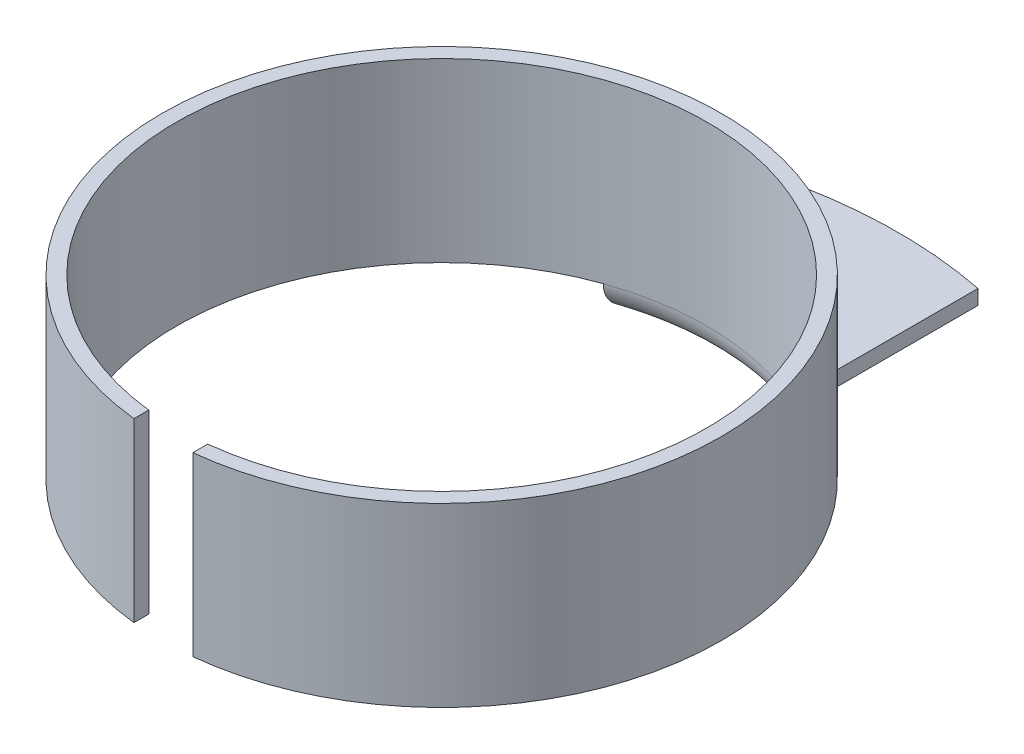
ISO-10303-21;
HEADER;
FILE_DESCRIPTION(('STEP AP214'),'2;1');
FILE_NAME('part.step','',(''),(''),'','','');
FILE_SCHEMA(('AUTOMOTIVE_DESIGN { 1 0 10303 214 1 1 1 1 }'));
ENDSEC;
DATA;
#1=APPLICATION_CONTEXT('core data for automotive mechanical design processes');
#2=APPLICATION_PROTOCOL_DEFINITION('international standard','automotive_design',2000,#1);
#3=PRODUCT_CONTEXT('',#1,'mechanical');
#4=PRODUCT('Part','Part','',(#3));
#5=PRODUCT_RELATED_PRODUCT_CATEGORY('part','',(#4));
#6=PRODUCT_DEFINITION_FORMATION('','',#4);
#7=PRODUCT_DEFINITION_CONTEXT('part definition',#1,'design');
#8=PRODUCT_DEFINITION('design','',#6,#7);
#9=PRODUCT_DEFINITION_SHAPE('','',#8);
#10=(LENGTH_UNIT() NAMED_UNIT(*) SI_UNIT(.MILLI.,.METRE.));
#11=(NAMED_UNIT(*) PLANE_ANGLE_UNIT() SI_UNIT($,.RADIAN.));
#12=(NAMED_UNIT(*) SI_UNIT($,.STERADIAN.) SOLID_ANGLE_UNIT());
#13=UNCERTAINTY_MEASURE_WITH_UNIT(LENGTH_MEASURE(1.E-05),#10,'distance_accuracy_value','');
#14=(GEOMETRIC_REPRESENTATION_CONTEXT(3) GLOBAL_UNCERTAINTY_ASSIGNED_CONTEXT((#13)) GLOBAL_UNIT_ASSIGNED_CONTEXT((#10,
#11,#12)) REPRESENTATION_CONTEXT('',''));
#15=CARTESIAN_POINT('',(0.,0.,0.));
#16=DIRECTION('',(0.,0.,1.));
#17=DIRECTION('',(1.,0.,0.));
#18=AXIS2_PLACEMENT_3D('',#15,#16,#17);
#19=CARTESIAN_POINT('',(0.,0.,0.));
#20=DIRECTION('',(0.,-1.,0.));
#21=DIRECTION('',(0.,0.,-1.));
#22=AXIS2_PLACEMENT_3D('',#19,#20,#21);
#23=CYLINDRICAL_SURFACE('',#22,4.5);
#24=CARTESIAN_POINT('',(0.,0.5,0.));
#25=DIRECTION('',(0.,-1.,0.));
#26=DIRECTION('',(0.,0.,-1.));
#27=AXIS2_PLACEMENT_3D('',#24,#25,#26);
#28=CIRCLE('',#27,4.5);
#29=CARTESIAN_POINT('',(-1.5,0.5,-4.24264068711928));
#30=VERTEX_POINT('',#29);
#31=CARTESIAN_POINT('',(-0.5,0.5,4.47213595499958));
#32=VERTEX_POINT('',#31);
#33=EDGE_CURVE('E230',#30,#32,#28,.F.);
#34=ORIENTED_EDGE('',*,*,#33,.F.);
#35=CARTESIAN_POINT('',(0.,0.5,0.));
#36=DIRECTION('',(0.,-1.,0.));
#37=DIRECTION('',(0.,0.,-1.));
#38=AXIS2_PLACEMENT_3D('',#35,#36,#37);
#39=CIRCLE('',#38,4.5);
#40=CARTESIAN_POINT('',(1.5,0.5,-4.24264068711928));
#41=VERTEX_POINT('',#40);
#42=EDGE_CURVE('E249',#30,#41,#39,.T.);
#43=ORIENTED_EDGE('',*,*,#42,.T.);
#44=CARTESIAN_POINT('',(0.499999999999999,0.5,4.47213595499958));
#45=VERTEX_POINT('',#44);
#46=EDGE_CURVE('E132',#45,#41,#28,.F.);
#47=ORIENTED_EDGE('',*,*,#46,.F.);
#48=DIRECTION('',(0.,1.,0.));
#49=VECTOR('',#48,1.);
#50=CARTESIAN_POINT('',(0.499999999999999,0.,4.47213595499958));
#51=LINE('',#50,#49);
#52=CARTESIAN_POINT('',(0.499999999999999,3.5,4.47213595499958));
#53=VERTEX_POINT('',#52);
#54=EDGE_CURVE('E114',#45,#53,#51,.T.);
#55=ORIENTED_EDGE('',*,*,#54,.T.);
#56=CARTESIAN_POINT('',(0.,3.5,0.));
#57=DIRECTION('',(0.,-1.,0.));
#58=DIRECTION('',(0.,0.,-1.));
#59=AXIS2_PLACEMENT_3D('',#56,#57,#58);
#60=CIRCLE('',#59,4.5);
#61=CARTESIAN_POINT('',(-0.5,3.5,4.47213595499958));
#62=VERTEX_POINT('',#61);
#63=EDGE_CURVE('E129',#62,#53,#60,.T.);
#64=ORIENTED_EDGE('',*,*,#63,.F.);
#65=DIRECTION('',(0.,1.,0.));
#66=VECTOR('',#65,1.);
#67=CARTESIAN_POINT('',(-0.5,0.,4.47213595499958));
#68=LINE('',#67,#66);
#69=EDGE_CURVE('E133',#32,#62,#68,.T.);
#70=ORIENTED_EDGE('',*,*,#69,.F.);
#71=EDGE_LOOP('',(#34,#43,#47,#55,#64,#70));
#72=FACE_BOUND('',#71,.T.);
#73=ADVANCED_FACE('F31',(#72),#23,.F.);
#74=CARTESIAN_POINT('',(4.5,3.5,0.));
#75=DIRECTION('',(0.,1.,0.));
#76=DIRECTION('',(0.,0.,1.));
#77=AXIS2_PLACEMENT_3D('',#74,#75,#76);
#78=PLANE('',#77);
#79=ORIENTED_EDGE('',*,*,#63,.T.);
#80=DIRECTION('',(0.,0.,1.));
#81=VECTOR('',#80,1.);
#82=CARTESIAN_POINT('',(0.499999999999992,3.5,0.));
#83=LINE('',#82,#81);
#84=CARTESIAN_POINT('',(0.5,3.5,4.7236109069228));
#85=VERTEX_POINT('',#84);
#86=EDGE_CURVE('E111',#53,#85,#83,.T.);
#87=ORIENTED_EDGE('',*,*,#86,.T.);
#88=CARTESIAN_POINT('',(0.,3.5,0.));
#89=DIRECTION('',(0.,-1.,0.));
#90=DIRECTION('',(0.,0.,-1.));
#91=AXIS2_PLACEMENT_3D('',#88,#89,#90);
#92=CIRCLE('',#91,4.75);
#93=CARTESIAN_POINT('',(-0.499999999999999,3.5,4.7236109069228));
#94=VERTEX_POINT('',#93);
#95=EDGE_CURVE('E138',#94,#85,#92,.T.);
#96=ORIENTED_EDGE('',*,*,#95,.F.);
#97=DIRECTION('',(0.,0.,1.));
#98=VECTOR('',#97,1.);
#99=CARTESIAN_POINT('',(-0.500000000000007,3.5,0.));
#100=LINE('',#99,#98);
#101=EDGE_CURVE('E122',#62,#94,#100,.T.);
#102=ORIENTED_EDGE('',*,*,#101,.F.);
#103=EDGE_LOOP('',(#79,#87,#96,#102));
#104=FACE_BOUND('',#103,.T.);
#105=ADVANCED_FACE('F136',(#104),#78,.T.);
#106=CARTESIAN_POINT('',(0.,0.,0.));
#107=DIRECTION('',(0.,-1.,0.));
#108=DIRECTION('',(0.,0.,-1.));
#109=AXIS2_PLACEMENT_3D('',#106,#107,#108);
#110=CYLINDRICAL_SURFACE('',#109,4.75);
#111=CARTESIAN_POINT('',(0.,0.5,0.));
#112=DIRECTION('',(0.,-1.,0.));
#113=DIRECTION('',(0.,0.,-1.));
#114=AXIS2_PLACEMENT_3D('',#111,#112,#113);
#115=CIRCLE('',#114,4.75);
#116=CARTESIAN_POINT('',(0.5,0.5,4.7236109069228));
#117=VERTEX_POINT('',#116);
#118=CARTESIAN_POINT('',(1.5,0.5,-4.50693909432999));
#119=VERTEX_POINT('',#118);
#120=EDGE_CURVE('E147',#117,#119,#115,.F.);
#121=ORIENTED_EDGE('',*,*,#120,.T.);
#122=CARTESIAN_POINT('',(0.,0.5,0.));
#123=DIRECTION('',(0.,1.,0.));
#124=DIRECTION('',(0.,0.,1.));
#125=AXIS2_PLACEMENT_3D('',#122,#123,#124);
#126=CIRCLE('',#125,4.75);
#127=CARTESIAN_POINT('',(-1.5,0.5,-4.50693909432999));
#128=VERTEX_POINT('',#127);
#129=EDGE_CURVE('E158',#119,#128,#126,.T.);
#130=ORIENTED_EDGE('',*,*,#129,.T.);
#131=CARTESIAN_POINT('',(-0.499999999999999,0.5,4.7236109069228));
#132=VERTEX_POINT('',#131);
#133=EDGE_CURVE('E148',#128,#132,#115,.F.);
#134=ORIENTED_EDGE('',*,*,#133,.T.);
#135=DIRECTION('',(0.,1.,0.));
#136=VECTOR('',#135,1.);
#137=CARTESIAN_POINT('',(-0.499999999999999,0.,4.7236109069228));
#138=LINE('',#137,#136);
#139=EDGE_CURVE('E234',#132,#94,#138,.T.);
#140=ORIENTED_EDGE('',*,*,#139,.T.);
#141=ORIENTED_EDGE('',*,*,#95,.T.);
#142=DIRECTION('',(0.,1.,0.));
#143=VECTOR('',#142,1.);
#144=CARTESIAN_POINT('',(0.5,0.,4.7236109069228));
#145=LINE('',#144,#143);
#146=EDGE_CURVE('E117',#117,#85,#145,.T.);
#147=ORIENTED_EDGE('',*,*,#146,.F.);
#148=EDGE_LOOP('',(#121,#130,#134,#140,#141,#147));
#149=FACE_BOUND('',#148,.T.);
#150=ADVANCED_FACE('F189',(#149),#110,.T.);
#151=CARTESIAN_POINT('',(0.,0.5,-17.1914213562373));
#152=DIRECTION('',(0.,-1.,0.));
#153=DIRECTION('',(0.,0.,-1.));
#154=AXIS2_PLACEMENT_3D('',#151,#152,#153);
#155=PLANE('',#154);
#156=ORIENTED_EDGE('',*,*,#120,.F.);
#157=DIRECTION('',(0.,0.,-1.));
#158=VECTOR('',#157,1.);
#159=CARTESIAN_POINT('',(0.499999999999962,0.5,-17.1914213562373));
#160=LINE('',#159,#158);
#161=EDGE_CURVE('E153',#117,#45,#160,.T.);
#162=ORIENTED_EDGE('',*,*,#161,.T.);
#163=ORIENTED_EDGE('',*,*,#46,.T.);
#164=DIRECTION('',(0.,0.,-1.));
#165=VECTOR('',#164,1.);
#166=CARTESIAN_POINT('',(1.5,0.5,-17.1914213562373));
#167=LINE('',#166,#165);
#168=EDGE_CURVE('E227',#41,#119,#167,.T.);
#169=ORIENTED_EDGE('',*,*,#168,.T.);
#170=EDGE_LOOP('',(#156,#162,#163,#169));
#171=FACE_BOUND('',#170,.T.);
#172=ADVANCED_FACE('F184',(#171),#155,.T.);
#173=CARTESIAN_POINT('',(7.75,0.,0.));
#174=DIRECTION('',(0.,-1.,0.));
#175=DIRECTION('',(0.,0.,-1.));
#176=AXIS2_PLACEMENT_3D('',#173,#174,#175);
#177=PLANE('',#176);
#178=DIRECTION('',(0.,0.,-1.));
#179=VECTOR('',#178,1.);
#180=CARTESIAN_POINT('',(1.5,0.,-17.1914213562373));
#181=LINE('',#180,#179);
#182=CARTESIAN_POINT('',(1.5,0.,-4.76969600708473));
#183=VERTEX_POINT('',#182);
#184=CARTESIAN_POINT('',(1.5,0.,-7.60345316287277));
#185=VERTEX_POINT('',#184);
#186=EDGE_CURVE('E223',#183,#185,#181,.T.);
#187=ORIENTED_EDGE('',*,*,#186,.F.);
#188=CARTESIAN_POINT('',(0.,0.,0.));
#189=DIRECTION('',(0.,-1.,0.));
#190=DIRECTION('',(0.,0.,-1.));
#191=AXIS2_PLACEMENT_3D('',#188,#189,#190);
#192=CIRCLE('',#191,5.);
#193=CARTESIAN_POINT('',(-1.5,0.,-4.76969600708473));
#194=VERTEX_POINT('',#193);
#195=EDGE_CURVE('E44',#183,#194,#192,.F.);
#196=ORIENTED_EDGE('',*,*,#195,.T.);
#197=DIRECTION('',(0.,0.,1.));
#198=VECTOR('',#197,1.);
#199=CARTESIAN_POINT('',(-1.5,0.,-17.1914213562373));
#200=LINE('',#199,#198);
#201=CARTESIAN_POINT('',(-1.5,0.,-7.60345316287277));
#202=VERTEX_POINT('',#201);
#203=EDGE_CURVE('E221',#202,#194,#200,.T.);
#204=ORIENTED_EDGE('',*,*,#203,.F.);
#205=CARTESIAN_POINT('',(0.,0.,0.));
#206=DIRECTION('',(0.,-1.,0.));
#207=DIRECTION('',(0.,0.,-1.));
#208=AXIS2_PLACEMENT_3D('',#205,#206,#207);
#209=CIRCLE('',#208,7.75);
#210=EDGE_CURVE('E209',#202,#185,#209,.T.);
#211=ORIENTED_EDGE('',*,*,#210,.T.);
#212=EDGE_LOOP('',(#187,#196,#204,#211));
#213=FACE_BOUND('',#212,.T.);
#214=ADVANCED_FACE('F179',(#213),#177,.T.);
#215=CARTESIAN_POINT('',(4.75,0.25,0.));
#216=DIRECTION('',(0.,1.,0.));
#217=DIRECTION('',(0.,0.,1.));
#218=AXIS2_PLACEMENT_3D('',#215,#216,#217);
#219=PLANE('',#218);
#220=DIRECTION('',(0.,0.,-1.));
#221=VECTOR('',#220,1.);
#222=CARTESIAN_POINT('',(-1.5,0.25,0.));
#223=LINE('',#222,#221);
#224=CARTESIAN_POINT('',(-1.5,0.25,-4.76969600708473));
#225=VERTEX_POINT('',#224);
#226=CARTESIAN_POINT('',(-1.5,0.25,-7.60345316287277));
#227=VERTEX_POINT('',#226);
#228=EDGE_CURVE('E212',#225,#227,#223,.T.);
#229=ORIENTED_EDGE('',*,*,#228,.F.);
#230=CARTESIAN_POINT('',(0.,0.25,0.));
#231=DIRECTION('',(0.,1.,0.));
#232=DIRECTION('',(0.,0.,1.));
#233=AXIS2_PLACEMENT_3D('',#230,#231,#232);
#234=CIRCLE('',#233,5.);
#235=CARTESIAN_POINT('',(1.5,0.25,-4.76969600708473));
#236=VERTEX_POINT('',#235);
#237=EDGE_CURVE('E155',#225,#236,#234,.F.);
#238=ORIENTED_EDGE('',*,*,#237,.T.);
#239=DIRECTION('',(0.,0.,1.));
#240=VECTOR('',#239,1.);
#241=CARTESIAN_POINT('',(1.5,0.25,0.));
#242=LINE('',#241,#240);
#243=CARTESIAN_POINT('',(1.5,0.25,-7.60345316287277));
#244=VERTEX_POINT('',#243);
#245=EDGE_CURVE('E215',#244,#236,#242,.T.);
#246=ORIENTED_EDGE('',*,*,#245,.F.);
#247=CARTESIAN_POINT('',(0.,0.25,0.));
#248=DIRECTION('',(0.,-1.,0.));
#249=DIRECTION('',(0.,0.,-1.));
#250=AXIS2_PLACEMENT_3D('',#247,#248,#249);
#251=CIRCLE('',#250,7.75);
#252=EDGE_CURVE('E142',#227,#244,#251,.T.);
#253=ORIENTED_EDGE('',*,*,#252,.F.);
#254=EDGE_LOOP('',(#229,#238,#246,#253));
#255=FACE_BOUND('',#254,.T.);
#256=ADVANCED_FACE('F183',(#255),#219,.T.);
#257=CARTESIAN_POINT('',(0.,0.,0.));
#258=DIRECTION('',(0.,-1.,0.));
#259=DIRECTION('',(0.,0.,-1.));
#260=AXIS2_PLACEMENT_3D('',#257,#258,#259);
#261=CYLINDRICAL_SURFACE('',#260,7.75);
#262=DIRECTION('',(0.,-1.,0.));
#263=VECTOR('',#262,1.);
#264=CARTESIAN_POINT('',(-1.5,0.,-7.60345316287277));
#265=LINE('',#264,#263);
#266=EDGE_CURVE('E140',#227,#202,#265,.T.);
#267=ORIENTED_EDGE('',*,*,#266,.F.);
#268=ORIENTED_EDGE('',*,*,#252,.T.);
#269=DIRECTION('',(0.,-1.,0.));
#270=VECTOR('',#269,1.);
#271=CARTESIAN_POINT('',(1.5,0.,-7.60345316287277));
#272=LINE('',#271,#270);
#273=EDGE_CURVE('E137',#185,#244,#272,.F.);
#274=ORIENTED_EDGE('',*,*,#273,.F.);
#275=ORIENTED_EDGE('',*,*,#210,.F.);
#276=EDGE_LOOP('',(#267,#268,#274,#275));
#277=FACE_BOUND('',#276,.T.);
#278=ADVANCED_FACE('F194',(#277),#261,.T.);
#279=CARTESIAN_POINT('',(-1.5,0.5,-17.1914213562373));
#280=DIRECTION('',(1.,0.,0.));
#281=DIRECTION('',(0.,0.,-1.));
#282=AXIS2_PLACEMENT_3D('',#279,#280,#281);
#283=PLANE('',#282);
#284=ORIENTED_EDGE('',*,*,#203,.T.);
#285=CARTESIAN_POINT('',(-1.5,0.,-4.76969600708473));
#286=CARTESIAN_POINT('',(-1.5,-1.78842096156848E-05,-4.73892941602474));
#287=CARTESIAN_POINT('',(-1.5,0.00258333606608406,-4.70816605204945));
#288=CARTESIAN_POINT('',(-1.5,0.0128699362947618,-4.64748606239024));
#289=CARTESIAN_POINT('',(-1.5,0.0205577235523921,-4.61756984462687));
#290=CARTESIAN_POINT('',(-1.5,0.0408706099006649,-4.55943378607881));
#291=CARTESIAN_POINT('',(-1.5,0.0534993423433167,-4.53121521132442));
#292=CARTESIAN_POINT('',(-1.5,0.0833979744913507,-4.47736316093821));
#293=CARTESIAN_POINT('',(-1.5,0.100665747133415,-4.45172850793248));
#294=CARTESIAN_POINT('',(-1.5,0.139059634342037,-4.4043395692584));
#295=CARTESIAN_POINT('',(-1.5,0.160105238861658,-4.3825201893248));
#296=CARTESIAN_POINT('',(-1.5,0.205738747197332,-4.34294506180048));
#297=CARTESIAN_POINT('',(-1.5,0.230326679889993,-4.32518934733929));
#298=CARTESIAN_POINT('',(-1.5,0.281030339322165,-4.29522417400671));
#299=CARTESIAN_POINT('',(-1.5,0.307009022462332,-4.28278256511014));
#300=CARTESIAN_POINT('',(-1.5,0.360750302166682,-4.26272638504723));
#301=CARTESIAN_POINT('',(-1.5,0.388510233826083,-4.25510478000839));
#302=CARTESIAN_POINT('',(-1.5,0.430450953268511,-4.2475866068568));
#303=CARTESIAN_POINT('',(-1.5,0.444305503668504,-4.24573278684713));
#304=CARTESIAN_POINT('',(-1.5,0.472104208014658,-4.24326058721559));
#305=CARTESIAN_POINT('',(-1.5,0.486048203856712,-4.24264042911616));
#306=CARTESIAN_POINT('',(-1.5,0.499999999999996,-4.24264068711926));
#307=B_SPLINE_CURVE_WITH_KNOTS('',3,(#285,#286,#287,#288,#289,#290,#291,#292,#293,#294,#295,
#296,#297,#298,#299,#300,#301,#302,#303,#304,#305,#306),.UNSPECIFIED.,.F.,.F.,(4,2,2,2,2,2,2,2,
2,2,4),(0.,0.0921870383829734,0.184417737092913,0.276716386029652,0.368972786790481,
0.459456552931209,0.549941056725847,0.635919878228938,0.72177293881255,0.763659638176585,
0.805485908749635),.UNSPECIFIED.);
#308=EDGE_CURVE('E11',#194,#30,#307,.T.);
#309=ORIENTED_EDGE('',*,*,#308,.T.);
#310=DIRECTION('',(0.,0.,1.));
#311=VECTOR('',#310,1.);
#312=CARTESIAN_POINT('',(-1.5,0.5,-17.1914213562373));
#313=LINE('',#312,#311);
#314=EDGE_CURVE('E220',#128,#30,#313,.T.);
#315=ORIENTED_EDGE('',*,*,#314,.F.);
#316=CARTESIAN_POINT('',(-1.5,0.5,-4.50693909432999));
#317=CARTESIAN_POINT('',(-1.5,0.486445531865697,-4.50692409636595));
#318=CARTESIAN_POINT('',(-1.5,0.472899058852666,-4.50809988175791));
#319=CARTESIAN_POINT('',(-1.5,0.446227887620188,-4.51271689440087));
#320=CARTESIAN_POINT('',(-1.5,0.433102311596244,-4.51615303487491));
#321=CARTESIAN_POINT('',(-1.5,0.407615139457057,-4.52517536393597));
#322=CARTESIAN_POINT('',(-1.5,0.395253508376193,-4.53076145403548));
#323=CARTESIAN_POINT('',(-1.5,0.371613308515853,-4.54388482770083));
#324=CARTESIAN_POINT('',(-1.5,0.36033500364704,-4.55142258507072));
#325=CARTESIAN_POINT('',(-1.5,0.33889756380705,-4.56839492037753));
#326=CARTESIAN_POINT('',(-1.5,0.328769003181995,-4.57786805691669));
#327=CARTESIAN_POINT('',(-1.5,0.31015583854114,-4.59831105483053));
#328=CARTESIAN_POINT('',(-1.5,0.301671670367458,-4.60928131170383));
#329=CARTESIAN_POINT('',(-1.5,0.286156432095863,-4.63296977967051));
#330=CARTESIAN_POINT('',(-1.5,0.279215174558571,-4.64574677460098));
#331=CARTESIAN_POINT('',(-1.5,0.267474129049237,-4.67224971697877));
#332=CARTESIAN_POINT('',(-1.5,0.262674429741987,-4.68597570368908));
#333=CARTESIAN_POINT('',(-1.5,0.256006433508511,-4.71136063778464));
#334=CARTESIAN_POINT('',(-1.5,0.253755941178873,-4.7229210349046));
#335=CARTESIAN_POINT('',(-1.5,0.25075257848282,-4.74621877493222));
#336=CARTESIAN_POINT('',(-1.5,0.249997675227335,-4.75795585577157));
#337=CARTESIAN_POINT('',(-1.5,0.25,-4.76969600708473));
#338=B_SPLINE_CURVE_WITH_KNOTS('',3,(#316,#317,#318,#319,#320,#321,#322,#323,#324,#325,#326,
#327,#328,#329,#330,#331,#332,#333,#334,#335,#336,#337),.UNSPECIFIED.,.F.,.F.,(4,2,2,2,2,2,2,2,
2,2,4),(0.,0.0406002175866123,0.0811093782643314,0.121616683469881,0.162133831823451,
0.203554719116673,0.244986569944548,0.288416575656634,0.331848379290994,0.367086695996839,
0.402277081841746),.UNSPECIFIED.);
#339=EDGE_CURVE('E166',#128,#225,#338,.T.);
#340=ORIENTED_EDGE('',*,*,#339,.T.);
#341=ORIENTED_EDGE('',*,*,#228,.T.);
#342=ORIENTED_EDGE('',*,*,#266,.T.);
#343=EDGE_LOOP('',(#284,#309,#315,#340,#341,#342));
#344=FACE_BOUND('',#343,.T.);
#345=ADVANCED_FACE('F197',(#344),#283,.F.);
#346=CARTESIAN_POINT('',(1.5,0.5,-17.1914213562373));
#347=DIRECTION('',(-1.,0.,0.));
#348=DIRECTION('',(0.,0.,1.));
#349=AXIS2_PLACEMENT_3D('',#346,#347,#348);
#350=PLANE('',#349);
#351=ORIENTED_EDGE('',*,*,#168,.F.);
#352=CARTESIAN_POINT('',(1.5,0.5,-4.24264068711928));
#353=CARTESIAN_POINT('',(1.5,0.47299009162306,-4.24260965302005));
#354=CARTESIAN_POINT('',(1.5,0.445997733091603,-4.24495997818652));
#355=CARTESIAN_POINT('',(1.5,0.392862189476703,-4.25418130658987));
#356=CARTESIAN_POINT('',(1.5,0.366717080245315,-4.26104118404621));
#357=CARTESIAN_POINT('',(1.5,0.315953491560072,-4.27904047327158));
#358=CARTESIAN_POINT('',(1.5,0.291334801923619,-4.29017929431845));
#359=CARTESIAN_POINT('',(1.5,0.244246729570753,-4.31632974814388));
#360=CARTESIAN_POINT('',(1.5,0.221778020097902,-4.33134258862567));
#361=CARTESIAN_POINT('',(1.5,0.178979852776925,-4.36518238633841));
#362=CARTESIAN_POINT('',(1.5,0.158720068219195,-4.38409731577675));
#363=CARTESIAN_POINT('',(1.5,0.121464643552548,-4.42490676702814));
#364=CARTESIAN_POINT('',(1.5,0.104469922791042,-4.44680212508724));
#365=CARTESIAN_POINT('',(1.5,0.0732744192439585,-4.49419873325158));
#366=CARTESIAN_POINT('',(1.5,0.0592715103364352,-4.51983016144061));
#367=CARTESIAN_POINT('',(1.5,0.0355580397962266,-4.5730071878737));
#368=CARTESIAN_POINT('',(1.5,0.0258476016277425,-4.6005528411502));
#369=CARTESIAN_POINT('',(1.5,0.0122828324259674,-4.65167515782415));
#370=CARTESIAN_POINT('',(1.5,0.00768264969249561,-4.67505732044908));
#371=CARTESIAN_POINT('',(1.5,0.00154076043620312,-4.72218968515504));
#372=CARTESIAN_POINT('',(1.5,-4.81452806937883E-06,-4.74593938329163));
#373=CARTESIAN_POINT('',(1.5,0.,-4.76969600708473));
#374=B_SPLINE_CURVE_WITH_KNOTS('',3,(#352,#353,#354,#355,#356,#357,#358,#359,#360,#361,#362,
#363,#364,#365,#366,#367,#368,#369,#370,#371,#372,#373),.UNSPECIFIED.,.F.,.F.,(4,2,2,2,2,2,2,2,
2,2,4),(0.,0.0809005749161024,0.161602300614875,0.242292889178275,0.323008663020916,
0.405795257821704,0.488605128876286,0.575840929497886,0.663079239116845,0.734376521547957,
0.805583453082663),.UNSPECIFIED.);
#375=EDGE_CURVE('E58',#41,#183,#374,.T.);
#376=ORIENTED_EDGE('',*,*,#375,.T.);
#377=ORIENTED_EDGE('',*,*,#186,.T.);
#378=ORIENTED_EDGE('',*,*,#273,.T.);
#379=ORIENTED_EDGE('',*,*,#245,.T.);
#380=CARTESIAN_POINT('',(1.5,0.25,-4.76969600708473));
#381=CARTESIAN_POINT('',(1.5,0.249990838872027,-4.75436712579706));
#382=CARTESIAN_POINT('',(1.5,0.251282545186797,-4.73903868838279));
#383=CARTESIAN_POINT('',(1.5,0.256397279546211,-4.70880085144264));
#384=CARTESIAN_POINT('',(1.5,0.260221792489711,-4.69389170308011));
#385=CARTESIAN_POINT('',(1.5,0.270335885901725,-4.66491722191576));
#386=CARTESIAN_POINT('',(1.5,0.276627568417307,-4.65085262048878));
#387=CARTESIAN_POINT('',(1.5,0.291529843259638,-4.62401640051537));
#388=CARTESIAN_POINT('',(1.5,0.300139212505738,-4.61124410487554));
#389=CARTESIAN_POINT('',(1.5,0.319261660827311,-4.58766609020098));
#390=CARTESIAN_POINT('',(1.5,0.329729723656804,-4.57682392723034));
#391=CARTESIAN_POINT('',(1.5,0.352422021512742,-4.55715558111665));
#392=CARTESIAN_POINT('',(1.5,0.364646316706868,-4.5483294670693));
#393=CARTESIAN_POINT('',(1.5,0.389876302340825,-4.53340383089123));
#394=CARTESIAN_POINT('',(1.5,0.402817181908283,-4.52719459929317));
#395=CARTESIAN_POINT('',(1.5,0.42958542142036,-4.51716400749531));
#396=CARTESIAN_POINT('',(1.5,0.443411541703586,-4.51333938526544));
#397=CARTESIAN_POINT('',(1.5,0.464475008019288,-4.50950415056284));
#398=CARTESIAN_POINT('',(1.5,0.471550871693155,-4.50854268783206));
#399=CARTESIAN_POINT('',(1.5,0.48574990433403,-4.50726054721923));
#400=CARTESIAN_POINT('',(1.5,0.492872988407172,-4.50693892885368));
#401=CARTESIAN_POINT('',(1.5,0.499999999999993,-4.50693909432995));
#402=B_SPLINE_CURVE_WITH_KNOTS('',3,(#380,#381,#382,#383,#384,#385,#386,#387,#388,#389,#390,
#391,#392,#393,#394,#395,#396,#397,#398,#399,#400,#401),.UNSPECIFIED.,.F.,.F.,(4,2,2,2,2,2,2,2,
2,2,4),(0.,0.0459325275642019,0.0918920076827456,0.137890731003665,0.18386522748026,
0.22884911328414,0.273834540582131,0.316680532087462,0.359467783012302,0.380865314550822,
0.402231371345609),.UNSPECIFIED.);
#403=EDGE_CURVE('E160',#236,#119,#402,.T.);
#404=ORIENTED_EDGE('',*,*,#403,.T.);
#405=EDGE_LOOP('',(#351,#376,#377,#378,#379,#404));
#406=FACE_BOUND('',#405,.T.);
#407=ADVANCED_FACE('F171',(#406),#350,.F.);
#408=DIRECTION('',(0.,0.,-1.));
#409=VECTOR('',#408,1.);
#410=CARTESIAN_POINT('',(-0.500000000000037,0.5,-17.1914213562373));
#411=LINE('',#410,#409);
#412=EDGE_CURVE('E151',#132,#32,#411,.T.);
#413=ORIENTED_EDGE('',*,*,#412,.F.);
#414=ORIENTED_EDGE('',*,*,#133,.F.);
#415=ORIENTED_EDGE('',*,*,#314,.T.);
#416=ORIENTED_EDGE('',*,*,#33,.T.);
#417=EDGE_LOOP('',(#413,#414,#415,#416));
#418=FACE_BOUND('',#417,.T.);
#419=ADVANCED_FACE('F246',(#418),#155,.T.);
#420=CARTESIAN_POINT('',(-0.500000000000007,0.,0.));
#421=DIRECTION('',(-1.,0.,0.));
#422=DIRECTION('',(0.,0.,1.));
#423=AXIS2_PLACEMENT_3D('',#420,#421,#422);
#424=PLANE('',#423);
#425=ORIENTED_EDGE('',*,*,#412,.T.);
#426=ORIENTED_EDGE('',*,*,#69,.T.);
#427=ORIENTED_EDGE('',*,*,#101,.T.);
#428=ORIENTED_EDGE('',*,*,#139,.F.);
#429=EDGE_LOOP('',(#425,#426,#427,#428));
#430=FACE_BOUND('',#429,.T.);
#431=ADVANCED_FACE('F239',(#430),#424,.F.);
#432=CARTESIAN_POINT('',(0.499999999999992,0.,0.));
#433=DIRECTION('',(-1.,0.,0.));
#434=DIRECTION('',(0.,0.,1.));
#435=AXIS2_PLACEMENT_3D('',#432,#433,#434);
#436=PLANE('',#435);
#437=ORIENTED_EDGE('',*,*,#146,.T.);
#438=ORIENTED_EDGE('',*,*,#86,.F.);
#439=ORIENTED_EDGE('',*,*,#54,.F.);
#440=ORIENTED_EDGE('',*,*,#161,.F.);
#441=EDGE_LOOP('',(#437,#438,#439,#440));
#442=FACE_BOUND('',#441,.T.);
#443=ADVANCED_FACE('F113',(#442),#436,.T.);
#444=CARTESIAN_POINT('',(0.,0.5,0.));
#445=DIRECTION('',(0.,1.,0.));
#446=DIRECTION('',(0.,0.,1.));
#447=AXIS2_PLACEMENT_3D('',#444,#445,#446);
#448=TOROIDAL_SURFACE('',#447,5.,0.25);
#449=ORIENTED_EDGE('',*,*,#339,.F.);
#450=ORIENTED_EDGE('',*,*,#129,.F.);
#451=ORIENTED_EDGE('',*,*,#403,.F.);
#452=ORIENTED_EDGE('',*,*,#237,.F.);
#453=EDGE_LOOP('',(#449,#450,#451,#452));
#454=FACE_BOUND('',#453,.T.);
#455=ADVANCED_FACE('F174',(#454),#448,.F.);
#456=CARTESIAN_POINT('',(0.,0.5,0.));
#457=DIRECTION('',(0.,-1.,0.));
#458=DIRECTION('',(0.,0.,-1.));
#459=AXIS2_PLACEMENT_3D('',#456,#457,#458);
#460=TOROIDAL_SURFACE('',#459,5.,0.5);
#461=ORIENTED_EDGE('',*,*,#308,.F.);
#462=ORIENTED_EDGE('',*,*,#195,.F.);
#463=ORIENTED_EDGE('',*,*,#375,.F.);
#464=ORIENTED_EDGE('',*,*,#42,.F.);
#465=EDGE_LOOP('',(#461,#462,#463,#464));
#466=FACE_BOUND('',#465,.T.);
#467=ADVANCED_FACE('F33',(#466),#460,.T.);
#468=CLOSED_SHELL('',(#73,#105,#150,#172,#214,#256,#278,#345,#407,#419,#431,#443,#455,#467));
#469=MANIFOLD_SOLID_BREP('B2',#468);
#470=ADVANCED_BREP_SHAPE_REPRESENTATION('',(#18,#469),#14);
#471=SHAPE_DEFINITION_REPRESENTATION(#9,#470);
ENDSEC;
END-ISO-10303-21;
